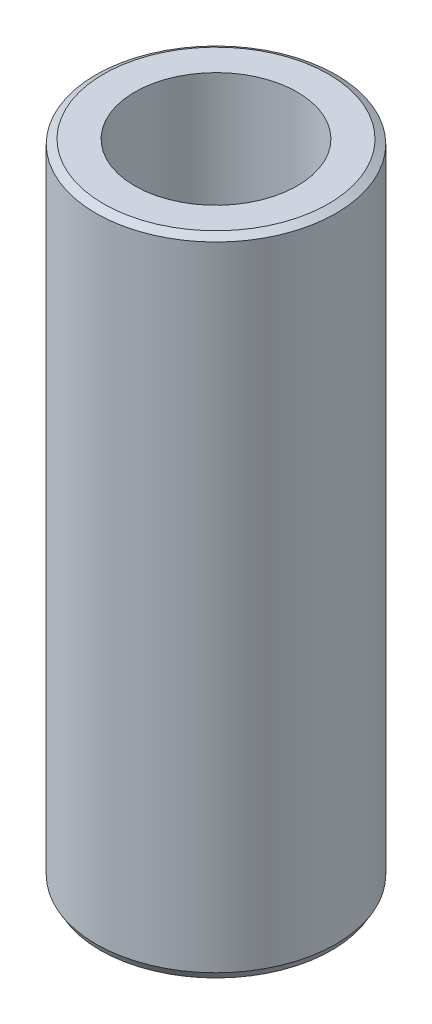
ISO-10303-21;
HEADER;
FILE_DESCRIPTION(('STEP AP214'),'2;1');
FILE_NAME('part.step','',(''),(''),'','','');
FILE_SCHEMA(('AUTOMOTIVE_DESIGN { 1 0 10303 214 1 1 1 1 }'));
ENDSEC;
DATA;
#1=APPLICATION_CONTEXT('core data for automotive mechanical design processes');
#2=APPLICATION_PROTOCOL_DEFINITION('international standard','automotive_design',2000,#1);
#3=PRODUCT_CONTEXT('',#1,'mechanical');
#4=PRODUCT('Part','Part','',(#3));
#5=PRODUCT_RELATED_PRODUCT_CATEGORY('part','',(#4));
#6=PRODUCT_DEFINITION_FORMATION('','',#4);
#7=PRODUCT_DEFINITION_CONTEXT('part definition',#1,'design');
#8=PRODUCT_DEFINITION('design','',#6,#7);
#9=PRODUCT_DEFINITION_SHAPE('','',#8);
#10=(LENGTH_UNIT() NAMED_UNIT(*) SI_UNIT(.MILLI.,.METRE.));
#11=(NAMED_UNIT(*) PLANE_ANGLE_UNIT() SI_UNIT($,.RADIAN.));
#12=(NAMED_UNIT(*) SI_UNIT($,.STERADIAN.) SOLID_ANGLE_UNIT());
#13=UNCERTAINTY_MEASURE_WITH_UNIT(LENGTH_MEASURE(1.E-05),#10,'distance_accuracy_value','');
#14=(GEOMETRIC_REPRESENTATION_CONTEXT(3) GLOBAL_UNCERTAINTY_ASSIGNED_CONTEXT((#13)) GLOBAL_UNIT_ASSIGNED_CONTEXT((#10,
#11,#12)) REPRESENTATION_CONTEXT('',''));
#15=CARTESIAN_POINT('',(0.,0.,0.));
#16=DIRECTION('',(0.,0.,1.));
#17=DIRECTION('',(1.,0.,0.));
#18=AXIS2_PLACEMENT_3D('',#15,#16,#17);
#19=CARTESIAN_POINT('',(0.,322.27901936632,0.));
#20=DIRECTION('',(0.,-1.,0.));
#21=DIRECTION('',(0.,0.,-1.));
#22=AXIS2_PLACEMENT_3D('',#19,#20,#21);
#23=CYLINDRICAL_SURFACE('',#22,60.);
#24=CARTESIAN_POINT('',(0.,320.085029324353,0.));
#25=DIRECTION('',(0.,1.,0.));
#26=DIRECTION('',(0.,0.,1.));
#27=AXIS2_PLACEMENT_3D('',#24,#25,#26);
#28=CIRCLE('',#27,60.);
#29=CARTESIAN_POINT('',(0.,320.085029324353,60.));
#30=VERTEX_POINT('',#29);
#31=EDGE_CURVE('E50',#30,#30,#28,.F.);
#32=ORIENTED_EDGE('',*,*,#31,.T.);
#33=EDGE_LOOP('',(#32));
#34=FACE_BOUND('',#33,.T.);
#35=CARTESIAN_POINT('',(0.,3.80010222398719,0.));
#36=DIRECTION('',(0.,1.,0.));
#37=DIRECTION('',(0.,0.,1.));
#38=AXIS2_PLACEMENT_3D('',#35,#36,#37);
#39=CIRCLE('',#38,60.);
#40=CARTESIAN_POINT('',(0.,3.80010222398719,60.));
#41=VERTEX_POINT('',#40);
#42=EDGE_CURVE('E51',#41,#41,#39,.T.);
#43=ORIENTED_EDGE('',*,*,#42,.T.);
#44=EDGE_LOOP('',(#43));
#45=FACE_BOUND('',#44,.T.);
#46=ADVANCED_FACE('F39',(#34,#45),#23,.T.);
#47=CARTESIAN_POINT('',(0.,322.27901936632,0.));
#48=DIRECTION('',(0.,1.,0.));
#49=DIRECTION('',(0.,0.,1.));
#50=AXIS2_PLACEMENT_3D('',#47,#48,#49);
#51=PLANE('',#50);
#52=CARTESIAN_POINT('',(0.,322.27901936632,0.));
#53=DIRECTION('',(0.,1.,0.));
#54=DIRECTION('',(0.,0.,1.));
#55=AXIS2_PLACEMENT_3D('',#52,#53,#54);
#56=CIRCLE('',#55,56.1998977760129);
#57=CARTESIAN_POINT('',(0.,322.27901936632,56.1998977760129));
#58=VERTEX_POINT('',#57);
#59=EDGE_CURVE('E54',#58,#58,#56,.T.);
#60=ORIENTED_EDGE('',*,*,#59,.T.);
#61=EDGE_LOOP('',(#60));
#62=FACE_BOUND('',#61,.T.);
#63=CARTESIAN_POINT('',(0.,322.27901936632,0.));
#64=DIRECTION('',(0.,1.,0.));
#65=DIRECTION('',(0.,0.,1.));
#66=AXIS2_PLACEMENT_3D('',#63,#64,#65);
#67=CIRCLE('',#66,40.627902377883);
#68=CARTESIAN_POINT('',(0.,322.27901936632,40.627902377883));
#69=VERTEX_POINT('',#68);
#70=EDGE_CURVE('E58',#69,#69,#67,.T.);
#71=ORIENTED_EDGE('',*,*,#70,.F.);
#72=EDGE_LOOP('',(#71));
#73=FACE_BOUND('',#72,.T.);
#74=ADVANCED_FACE('F69',(#62,#73),#51,.T.);
#75=CARTESIAN_POINT('',(0.,0.,0.));
#76=DIRECTION('',(0.,1.,0.));
#77=DIRECTION('',(0.,0.,1.));
#78=AXIS2_PLACEMENT_3D('',#75,#76,#77);
#79=PLANE('',#78);
#80=CARTESIAN_POINT('',(0.,0.,0.));
#81=DIRECTION('',(0.,1.,0.));
#82=DIRECTION('',(0.,0.,1.));
#83=AXIS2_PLACEMENT_3D('',#80,#81,#82);
#84=CIRCLE('',#83,57.8060099580329);
#85=CARTESIAN_POINT('',(0.,0.,57.8060099580329));
#86=VERTEX_POINT('',#85);
#87=EDGE_CURVE('E10',#86,#86,#84,.F.);
#88=ORIENTED_EDGE('',*,*,#87,.T.);
#89=EDGE_LOOP('',(#88));
#90=FACE_BOUND('',#89,.T.);
#91=CARTESIAN_POINT('',(0.,0.,0.));
#92=DIRECTION('',(0.,1.,0.));
#93=DIRECTION('',(0.,0.,1.));
#94=AXIS2_PLACEMENT_3D('',#91,#92,#93);
#95=CIRCLE('',#94,40.627902377883);
#96=CARTESIAN_POINT('',(0.,0.,40.627902377883));
#97=VERTEX_POINT('',#96);
#98=EDGE_CURVE('E63',#97,#97,#95,.T.);
#99=ORIENTED_EDGE('',*,*,#98,.T.);
#100=EDGE_LOOP('',(#99));
#101=FACE_BOUND('',#100,.T.);
#102=ADVANCED_FACE('F75',(#90,#101),#79,.F.);
#103=CARTESIAN_POINT('',(0.,322.27901936632,0.));
#104=DIRECTION('',(0.,-1.,0.));
#105=DIRECTION('',(0.,0.,-1.));
#106=AXIS2_PLACEMENT_3D('',#103,#104,#105);
#107=CYLINDRICAL_SURFACE('',#106,40.627902377883);
#108=ORIENTED_EDGE('',*,*,#70,.T.);
#109=EDGE_LOOP('',(#108));
#110=FACE_BOUND('',#109,.T.);
#111=ORIENTED_EDGE('',*,*,#98,.F.);
#112=EDGE_LOOP('',(#111));
#113=FACE_BOUND('',#112,.T.);
#114=ADVANCED_FACE('F70',(#110,#113),#107,.F.);
#115=CARTESIAN_POINT('',(0.,322.27901936632,0.));
#116=DIRECTION('',(0.,-1.,0.));
#117=DIRECTION('',(0.,0.,-1.));
#118=AXIS2_PLACEMENT_3D('',#115,#116,#117);
#119=CONICAL_SURFACE('',#118,56.1998977760129,1.0471975511966);
#120=ORIENTED_EDGE('',*,*,#31,.F.);
#121=EDGE_LOOP('',(#120));
#122=FACE_BOUND('',#121,.T.);
#123=ORIENTED_EDGE('',*,*,#59,.F.);
#124=EDGE_LOOP('',(#123));
#125=FACE_BOUND('',#124,.T.);
#126=ADVANCED_FACE('F81',(#122,#125),#119,.T.);
#127=CARTESIAN_POINT('',(0.,3.80010222398719,0.));
#128=DIRECTION('',(0.,1.,0.));
#129=DIRECTION('',(0.,0.,1.));
#130=AXIS2_PLACEMENT_3D('',#127,#128,#129);
#131=CONICAL_SURFACE('',#130,60.,0.523598775598302);
#132=ORIENTED_EDGE('',*,*,#87,.F.);
#133=EDGE_LOOP('',(#132));
#134=FACE_BOUND('',#133,.T.);
#135=ORIENTED_EDGE('',*,*,#42,.F.);
#136=EDGE_LOOP('',(#135));
#137=FACE_BOUND('',#136,.T.);
#138=ADVANCED_FACE('F45',(#134,#137),#131,.T.);
#139=CLOSED_SHELL('',(#46,#74,#102,#114,#126,#138));
#140=MANIFOLD_SOLID_BREP('B2',#139);
#141=ADVANCED_BREP_SHAPE_REPRESENTATION('',(#18,#140),#14);
#142=SHAPE_DEFINITION_REPRESENTATION(#9,#141);
ENDSEC;
END-ISO-10303-21;
